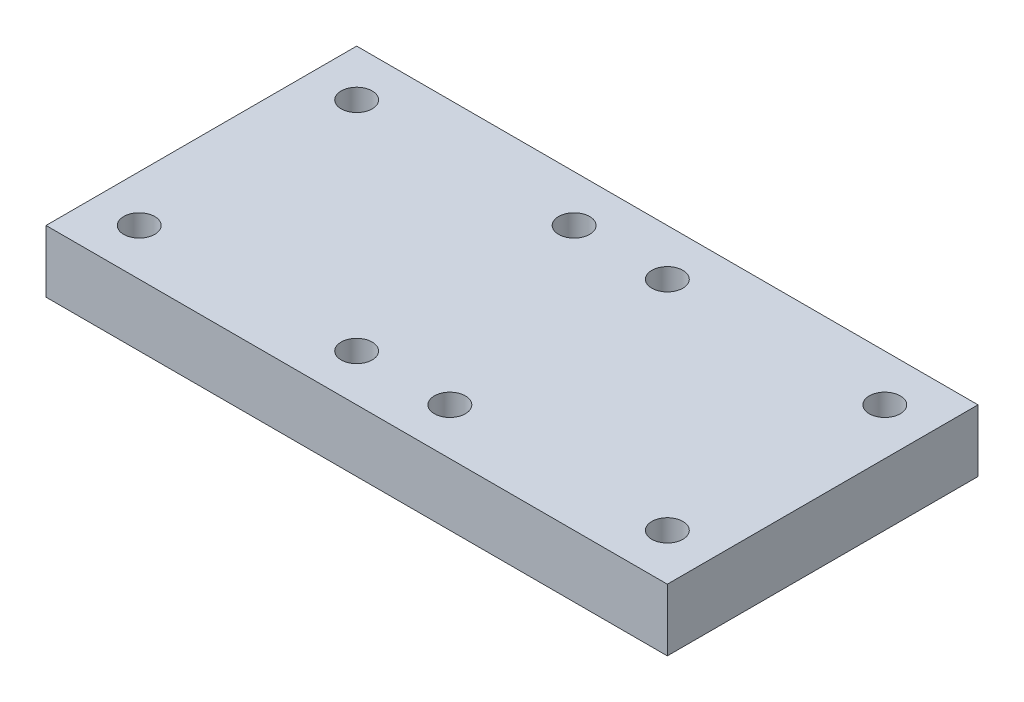
ISO-10303-21;
HEADER;
FILE_DESCRIPTION(('STEP AP214'),'2;1');
FILE_NAME('part.step','',(''),(''),'','','');
FILE_SCHEMA(('AUTOMOTIVE_DESIGN { 1 0 10303 214 1 1 1 1 }'));
ENDSEC;
DATA;
#1=APPLICATION_CONTEXT('core data for automotive mechanical design processes');
#2=APPLICATION_PROTOCOL_DEFINITION('international standard','automotive_design',2000,#1);
#3=PRODUCT_CONTEXT('',#1,'mechanical');
#4=PRODUCT('Part','Part','',(#3));
#5=PRODUCT_RELATED_PRODUCT_CATEGORY('part','',(#4));
#6=PRODUCT_DEFINITION_FORMATION('','',#4);
#7=PRODUCT_DEFINITION_CONTEXT('part definition',#1,'design');
#8=PRODUCT_DEFINITION('design','',#6,#7);
#9=PRODUCT_DEFINITION_SHAPE('','',#8);
#10=(LENGTH_UNIT() NAMED_UNIT(*) SI_UNIT(.MILLI.,.METRE.));
#11=(NAMED_UNIT(*) PLANE_ANGLE_UNIT() SI_UNIT($,.RADIAN.));
#12=(NAMED_UNIT(*) SI_UNIT($,.STERADIAN.) SOLID_ANGLE_UNIT());
#13=UNCERTAINTY_MEASURE_WITH_UNIT(LENGTH_MEASURE(1.E-05),#10,'distance_accuracy_value','');
#14=(GEOMETRIC_REPRESENTATION_CONTEXT(3) GLOBAL_UNCERTAINTY_ASSIGNED_CONTEXT((#13)) GLOBAL_UNIT_ASSIGNED_CONTEXT((#10,
#11,#12)) REPRESENTATION_CONTEXT('',''));
#15=CARTESIAN_POINT('',(0.,0.,0.));
#16=DIRECTION('',(0.,0.,1.));
#17=DIRECTION('',(1.,0.,0.));
#18=AXIS2_PLACEMENT_3D('',#15,#16,#17);
#19=CARTESIAN_POINT('',(0.,10.,0.));
#20=DIRECTION('',(0.,1.,0.));
#21=DIRECTION('',(0.,0.,1.));
#22=AXIS2_PLACEMENT_3D('',#19,#20,#21);
#23=PLANE('',#22);
#24=CARTESIAN_POINT('',(-7.5,10.,17.5));
#25=DIRECTION('',(0.,1.,0.));
#26=DIRECTION('',(0.,0.,1.));
#27=AXIS2_PLACEMENT_3D('',#24,#25,#26);
#28=CIRCLE('',#27,2.5);
#29=CARTESIAN_POINT('',(-7.5,10.,20.));
#30=VERTEX_POINT('',#29);
#31=EDGE_CURVE('E178',#30,#30,#28,.T.);
#32=ORIENTED_EDGE('',*,*,#31,.F.);
#33=EDGE_LOOP('',(#32));
#34=FACE_BOUND('',#33,.T.);
#35=CARTESIAN_POINT('',(7.5,10.,17.5));
#36=DIRECTION('',(0.,1.,0.));
#37=DIRECTION('',(0.,0.,1.));
#38=AXIS2_PLACEMENT_3D('',#35,#36,#37);
#39=CIRCLE('',#38,2.5);
#40=CARTESIAN_POINT('',(7.5,10.,20.));
#41=VERTEX_POINT('',#40);
#42=EDGE_CURVE('E186',#41,#41,#39,.T.);
#43=ORIENTED_EDGE('',*,*,#42,.F.);
#44=EDGE_LOOP('',(#43));
#45=FACE_BOUND('',#44,.T.);
#46=CARTESIAN_POINT('',(7.5,10.,-17.5));
#47=DIRECTION('',(0.,1.,0.));
#48=DIRECTION('',(0.,0.,1.));
#49=AXIS2_PLACEMENT_3D('',#46,#47,#48);
#50=CIRCLE('',#49,2.5);
#51=CARTESIAN_POINT('',(7.5,10.,-15.));
#52=VERTEX_POINT('',#51);
#53=EDGE_CURVE('E170',#52,#52,#50,.T.);
#54=ORIENTED_EDGE('',*,*,#53,.F.);
#55=EDGE_LOOP('',(#54));
#56=FACE_BOUND('',#55,.T.);
#57=CARTESIAN_POINT('',(-7.5,10.,-17.5));
#58=DIRECTION('',(0.,1.,0.));
#59=DIRECTION('',(0.,0.,1.));
#60=AXIS2_PLACEMENT_3D('',#57,#58,#59);
#61=CIRCLE('',#60,2.5);
#62=CARTESIAN_POINT('',(-7.5,10.,-15.));
#63=VERTEX_POINT('',#62);
#64=EDGE_CURVE('E166',#63,#63,#61,.T.);
#65=ORIENTED_EDGE('',*,*,#64,.F.);
#66=EDGE_LOOP('',(#65));
#67=FACE_BOUND('',#66,.T.);
#68=CARTESIAN_POINT('',(42.5,10.,17.5));
#69=DIRECTION('',(0.,1.,0.));
#70=DIRECTION('',(0.,0.,1.));
#71=AXIS2_PLACEMENT_3D('',#68,#69,#70);
#72=CIRCLE('',#71,2.5);
#73=CARTESIAN_POINT('',(42.5,10.,20.));
#74=VERTEX_POINT('',#73);
#75=EDGE_CURVE('E146',#74,#74,#72,.T.);
#76=ORIENTED_EDGE('',*,*,#75,.F.);
#77=EDGE_LOOP('',(#76));
#78=FACE_BOUND('',#77,.T.);
#79=CARTESIAN_POINT('',(-42.5,10.,-17.5));
#80=DIRECTION('',(0.,1.,0.));
#81=DIRECTION('',(0.,0.,1.));
#82=AXIS2_PLACEMENT_3D('',#79,#80,#81);
#83=CIRCLE('',#82,2.5);
#84=CARTESIAN_POINT('',(-42.5,10.,-15.));
#85=VERTEX_POINT('',#84);
#86=EDGE_CURVE('E116',#85,#85,#83,.T.);
#87=ORIENTED_EDGE('',*,*,#86,.F.);
#88=EDGE_LOOP('',(#87));
#89=FACE_BOUND('',#88,.T.);
#90=DIRECTION('',(0.,0.,-1.));
#91=VECTOR('',#90,1.);
#92=CARTESIAN_POINT('',(50.,10.,-25.));
#93=LINE('',#92,#91);
#94=CARTESIAN_POINT('',(50.,10.,25.));
#95=VERTEX_POINT('',#94);
#96=CARTESIAN_POINT('',(50.,10.,-25.));
#97=VERTEX_POINT('',#96);
#98=EDGE_CURVE('E96',#95,#97,#93,.T.);
#99=ORIENTED_EDGE('',*,*,#98,.T.);
#100=DIRECTION('',(-1.,0.,0.));
#101=VECTOR('',#100,1.);
#102=CARTESIAN_POINT('',(-50.,10.,-25.));
#103=LINE('',#102,#101);
#104=CARTESIAN_POINT('',(-50.,10.,-25.));
#105=VERTEX_POINT('',#104);
#106=EDGE_CURVE('E91',#97,#105,#103,.T.);
#107=ORIENTED_EDGE('',*,*,#106,.T.);
#108=DIRECTION('',(0.,0.,1.));
#109=VECTOR('',#108,1.);
#110=CARTESIAN_POINT('',(-50.,10.,-25.));
#111=LINE('',#110,#109);
#112=CARTESIAN_POINT('',(-50.,10.,25.));
#113=VERTEX_POINT('',#112);
#114=EDGE_CURVE('E94',#105,#113,#111,.T.);
#115=ORIENTED_EDGE('',*,*,#114,.T.);
#116=DIRECTION('',(1.,0.,0.));
#117=VECTOR('',#116,1.);
#118=CARTESIAN_POINT('',(-50.,10.,25.));
#119=LINE('',#118,#117);
#120=EDGE_CURVE('E61',#113,#95,#119,.T.);
#121=ORIENTED_EDGE('',*,*,#120,.T.);
#122=EDGE_LOOP('',(#99,#107,#115,#121));
#123=FACE_BOUND('',#122,.T.);
#124=CARTESIAN_POINT('',(42.5,10.,-17.5));
#125=DIRECTION('',(0.,1.,0.));
#126=DIRECTION('',(0.,0.,1.));
#127=AXIS2_PLACEMENT_3D('',#124,#125,#126);
#128=CIRCLE('',#127,2.5);
#129=CARTESIAN_POINT('',(42.5,10.,-15.));
#130=VERTEX_POINT('',#129);
#131=EDGE_CURVE('E138',#130,#130,#128,.T.);
#132=ORIENTED_EDGE('',*,*,#131,.F.);
#133=EDGE_LOOP('',(#132));
#134=FACE_BOUND('',#133,.T.);
#135=CARTESIAN_POINT('',(-42.5,10.,17.5));
#136=DIRECTION('',(0.,1.,0.));
#137=DIRECTION('',(0.,0.,1.));
#138=AXIS2_PLACEMENT_3D('',#135,#136,#137);
#139=CIRCLE('',#138,2.5);
#140=CARTESIAN_POINT('',(-42.5,10.,20.));
#141=VERTEX_POINT('',#140);
#142=EDGE_CURVE('E154',#141,#141,#139,.T.);
#143=ORIENTED_EDGE('',*,*,#142,.F.);
#144=EDGE_LOOP('',(#143));
#145=FACE_BOUND('',#144,.T.);
#146=ADVANCED_FACE('F43',(#34,#45,#56,#67,#78,#89,#123,#134,#145),#23,.T.);
#147=CARTESIAN_POINT('',(0.,0.,0.));
#148=DIRECTION('',(0.,1.,0.));
#149=DIRECTION('',(0.,0.,1.));
#150=AXIS2_PLACEMENT_3D('',#147,#148,#149);
#151=PLANE('',#150);
#152=CARTESIAN_POINT('',(-7.5,0.,17.5));
#153=DIRECTION('',(0.,1.,0.));
#154=DIRECTION('',(0.,0.,1.));
#155=AXIS2_PLACEMENT_3D('',#152,#153,#154);
#156=CIRCLE('',#155,2.5);
#157=CARTESIAN_POINT('',(-7.5,0.,20.));
#158=VERTEX_POINT('',#157);
#159=EDGE_CURVE('E174',#158,#158,#156,.T.);
#160=ORIENTED_EDGE('',*,*,#159,.T.);
#161=EDGE_LOOP('',(#160));
#162=FACE_BOUND('',#161,.T.);
#163=CARTESIAN_POINT('',(7.5,0.,17.5));
#164=DIRECTION('',(0.,1.,0.));
#165=DIRECTION('',(0.,0.,1.));
#166=AXIS2_PLACEMENT_3D('',#163,#164,#165);
#167=CIRCLE('',#166,2.5);
#168=CARTESIAN_POINT('',(7.5,0.,20.));
#169=VERTEX_POINT('',#168);
#170=EDGE_CURVE('E182',#169,#169,#167,.T.);
#171=ORIENTED_EDGE('',*,*,#170,.T.);
#172=EDGE_LOOP('',(#171));
#173=FACE_BOUND('',#172,.T.);
#174=CARTESIAN_POINT('',(7.5,0.,-17.5));
#175=DIRECTION('',(0.,1.,0.));
#176=DIRECTION('',(0.,0.,1.));
#177=AXIS2_PLACEMENT_3D('',#174,#175,#176);
#178=CIRCLE('',#177,2.5);
#179=CARTESIAN_POINT('',(7.5,0.,-15.));
#180=VERTEX_POINT('',#179);
#181=EDGE_CURVE('E190',#180,#180,#178,.T.);
#182=ORIENTED_EDGE('',*,*,#181,.T.);
#183=EDGE_LOOP('',(#182));
#184=FACE_BOUND('',#183,.T.);
#185=CARTESIAN_POINT('',(-7.5,0.,-17.5));
#186=DIRECTION('',(0.,1.,0.));
#187=DIRECTION('',(0.,0.,1.));
#188=AXIS2_PLACEMENT_3D('',#185,#186,#187);
#189=CIRCLE('',#188,2.5);
#190=CARTESIAN_POINT('',(-7.5,0.,-15.));
#191=VERTEX_POINT('',#190);
#192=EDGE_CURVE('E162',#191,#191,#189,.T.);
#193=ORIENTED_EDGE('',*,*,#192,.T.);
#194=EDGE_LOOP('',(#193));
#195=FACE_BOUND('',#194,.T.);
#196=DIRECTION('',(0.,0.,-1.));
#197=VECTOR('',#196,1.);
#198=CARTESIAN_POINT('',(50.,0.,-25.));
#199=LINE('',#198,#197);
#200=CARTESIAN_POINT('',(50.,0.,25.));
#201=VERTEX_POINT('',#200);
#202=CARTESIAN_POINT('',(50.,0.,-25.));
#203=VERTEX_POINT('',#202);
#204=EDGE_CURVE('E112',#201,#203,#199,.T.);
#205=ORIENTED_EDGE('',*,*,#204,.F.);
#206=DIRECTION('',(1.,0.,0.));
#207=VECTOR('',#206,1.);
#208=CARTESIAN_POINT('',(-50.,0.,25.));
#209=LINE('',#208,#207);
#210=CARTESIAN_POINT('',(-50.,0.,25.));
#211=VERTEX_POINT('',#210);
#212=EDGE_CURVE('E84',#211,#201,#209,.T.);
#213=ORIENTED_EDGE('',*,*,#212,.F.);
#214=DIRECTION('',(0.,0.,1.));
#215=VECTOR('',#214,1.);
#216=CARTESIAN_POINT('',(-50.,0.,-25.));
#217=LINE('',#216,#215);
#218=CARTESIAN_POINT('',(-50.,0.,-25.));
#219=VERTEX_POINT('',#218);
#220=EDGE_CURVE('E78',#219,#211,#217,.T.);
#221=ORIENTED_EDGE('',*,*,#220,.F.);
#222=DIRECTION('',(-1.,0.,0.));
#223=VECTOR('',#222,1.);
#224=CARTESIAN_POINT('',(-50.,0.,-25.));
#225=LINE('',#224,#223);
#226=EDGE_CURVE('E101',#203,#219,#225,.T.);
#227=ORIENTED_EDGE('',*,*,#226,.F.);
#228=EDGE_LOOP('',(#205,#213,#221,#227));
#229=FACE_BOUND('',#228,.T.);
#230=CARTESIAN_POINT('',(-42.5,0.,-17.5));
#231=DIRECTION('',(0.,1.,0.));
#232=DIRECTION('',(0.,0.,1.));
#233=AXIS2_PLACEMENT_3D('',#230,#231,#232);
#234=CIRCLE('',#233,2.5);
#235=CARTESIAN_POINT('',(-42.5,0.,-15.));
#236=VERTEX_POINT('',#235);
#237=EDGE_CURVE('E134',#236,#236,#234,.T.);
#238=ORIENTED_EDGE('',*,*,#237,.T.);
#239=EDGE_LOOP('',(#238));
#240=FACE_BOUND('',#239,.T.);
#241=CARTESIAN_POINT('',(42.5,0.,-17.5));
#242=DIRECTION('',(0.,1.,0.));
#243=DIRECTION('',(0.,0.,1.));
#244=AXIS2_PLACEMENT_3D('',#241,#242,#243);
#245=CIRCLE('',#244,2.5);
#246=CARTESIAN_POINT('',(42.5,0.,-15.));
#247=VERTEX_POINT('',#246);
#248=EDGE_CURVE('E142',#247,#247,#245,.T.);
#249=ORIENTED_EDGE('',*,*,#248,.T.);
#250=EDGE_LOOP('',(#249));
#251=FACE_BOUND('',#250,.T.);
#252=CARTESIAN_POINT('',(42.5,0.,17.5));
#253=DIRECTION('',(0.,1.,0.));
#254=DIRECTION('',(0.,0.,1.));
#255=AXIS2_PLACEMENT_3D('',#252,#253,#254);
#256=CIRCLE('',#255,2.5);
#257=CARTESIAN_POINT('',(42.5,0.,20.));
#258=VERTEX_POINT('',#257);
#259=EDGE_CURVE('E150',#258,#258,#256,.T.);
#260=ORIENTED_EDGE('',*,*,#259,.T.);
#261=EDGE_LOOP('',(#260));
#262=FACE_BOUND('',#261,.T.);
#263=CARTESIAN_POINT('',(-42.5,0.,17.5));
#264=DIRECTION('',(0.,1.,0.));
#265=DIRECTION('',(0.,0.,1.));
#266=AXIS2_PLACEMENT_3D('',#263,#264,#265);
#267=CIRCLE('',#266,2.5);
#268=CARTESIAN_POINT('',(-42.5,0.,20.));
#269=VERTEX_POINT('',#268);
#270=EDGE_CURVE('E158',#269,#269,#267,.T.);
#271=ORIENTED_EDGE('',*,*,#270,.T.);
#272=EDGE_LOOP('',(#271));
#273=FACE_BOUND('',#272,.T.);
#274=ADVANCED_FACE('F129',(#162,#173,#184,#195,#229,#240,#251,#262,#273),#151,.F.);
#275=CARTESIAN_POINT('',(50.,10.,-25.));
#276=DIRECTION('',(-1.,0.,0.));
#277=DIRECTION('',(0.,0.,1.));
#278=AXIS2_PLACEMENT_3D('',#275,#276,#277);
#279=PLANE('',#278);
#280=ORIENTED_EDGE('',*,*,#204,.T.);
#281=DIRECTION('',(0.,-1.,0.));
#282=VECTOR('',#281,1.);
#283=CARTESIAN_POINT('',(50.,10.,-25.));
#284=LINE('',#283,#282);
#285=EDGE_CURVE('E11',#97,#203,#284,.T.);
#286=ORIENTED_EDGE('',*,*,#285,.F.);
#287=ORIENTED_EDGE('',*,*,#98,.F.);
#288=DIRECTION('',(0.,-1.,0.));
#289=VECTOR('',#288,1.);
#290=CARTESIAN_POINT('',(50.,10.,25.));
#291=LINE('',#290,#289);
#292=EDGE_CURVE('E108',#95,#201,#291,.T.);
#293=ORIENTED_EDGE('',*,*,#292,.T.);
#294=EDGE_LOOP('',(#280,#286,#287,#293));
#295=FACE_BOUND('',#294,.T.);
#296=ADVANCED_FACE('F45',(#295),#279,.F.);
#297=CARTESIAN_POINT('',(-50.,10.,-25.));
#298=DIRECTION('',(0.,0.,1.));
#299=DIRECTION('',(1.,0.,0.));
#300=AXIS2_PLACEMENT_3D('',#297,#298,#299);
#301=PLANE('',#300);
#302=ORIENTED_EDGE('',*,*,#226,.T.);
#303=DIRECTION('',(0.,-1.,0.));
#304=VECTOR('',#303,1.);
#305=CARTESIAN_POINT('',(-50.,10.,-25.));
#306=LINE('',#305,#304);
#307=EDGE_CURVE('E53',#105,#219,#306,.T.);
#308=ORIENTED_EDGE('',*,*,#307,.F.);
#309=ORIENTED_EDGE('',*,*,#106,.F.);
#310=ORIENTED_EDGE('',*,*,#285,.T.);
#311=EDGE_LOOP('',(#302,#308,#309,#310));
#312=FACE_BOUND('',#311,.T.);
#313=ADVANCED_FACE('F100',(#312),#301,.F.);
#314=CARTESIAN_POINT('',(-50.,10.,-25.));
#315=DIRECTION('',(1.,0.,0.));
#316=DIRECTION('',(0.,0.,-1.));
#317=AXIS2_PLACEMENT_3D('',#314,#315,#316);
#318=PLANE('',#317);
#319=ORIENTED_EDGE('',*,*,#220,.T.);
#320=DIRECTION('',(0.,-1.,0.));
#321=VECTOR('',#320,1.);
#322=CARTESIAN_POINT('',(-50.,10.,25.));
#323=LINE('',#322,#321);
#324=EDGE_CURVE('E103',#113,#211,#323,.T.);
#325=ORIENTED_EDGE('',*,*,#324,.F.);
#326=ORIENTED_EDGE('',*,*,#114,.F.);
#327=ORIENTED_EDGE('',*,*,#307,.T.);
#328=EDGE_LOOP('',(#319,#325,#326,#327));
#329=FACE_BOUND('',#328,.T.);
#330=ADVANCED_FACE('F104',(#329),#318,.F.);
#331=CARTESIAN_POINT('',(-50.,10.,25.));
#332=DIRECTION('',(0.,0.,-1.));
#333=DIRECTION('',(-1.,0.,0.));
#334=AXIS2_PLACEMENT_3D('',#331,#332,#333);
#335=PLANE('',#334);
#336=ORIENTED_EDGE('',*,*,#212,.T.);
#337=ORIENTED_EDGE('',*,*,#292,.F.);
#338=ORIENTED_EDGE('',*,*,#120,.F.);
#339=ORIENTED_EDGE('',*,*,#324,.T.);
#340=EDGE_LOOP('',(#336,#337,#338,#339));
#341=FACE_BOUND('',#340,.T.);
#342=ADVANCED_FACE('F126',(#341),#335,.F.);
#343=CARTESIAN_POINT('',(-42.5,10.,-17.5));
#344=DIRECTION('',(0.,-1.,0.));
#345=DIRECTION('',(0.,0.,-1.));
#346=AXIS2_PLACEMENT_3D('',#343,#344,#345);
#347=CYLINDRICAL_SURFACE('',#346,2.5);
#348=ORIENTED_EDGE('',*,*,#86,.T.);
#349=EDGE_LOOP('',(#348));
#350=FACE_BOUND('',#349,.T.);
#351=ORIENTED_EDGE('',*,*,#237,.F.);
#352=EDGE_LOOP('',(#351));
#353=FACE_BOUND('',#352,.T.);
#354=ADVANCED_FACE('F210',(#350,#353),#347,.F.);
#355=CARTESIAN_POINT('',(42.5,10.,-17.5));
#356=DIRECTION('',(0.,-1.,0.));
#357=DIRECTION('',(0.,0.,-1.));
#358=AXIS2_PLACEMENT_3D('',#355,#356,#357);
#359=CYLINDRICAL_SURFACE('',#358,2.5);
#360=ORIENTED_EDGE('',*,*,#131,.T.);
#361=EDGE_LOOP('',(#360));
#362=FACE_BOUND('',#361,.T.);
#363=ORIENTED_EDGE('',*,*,#248,.F.);
#364=EDGE_LOOP('',(#363));
#365=FACE_BOUND('',#364,.T.);
#366=ADVANCED_FACE('F213',(#362,#365),#359,.F.);
#367=CARTESIAN_POINT('',(42.5,10.,17.5));
#368=DIRECTION('',(0.,-1.,0.));
#369=DIRECTION('',(0.,0.,-1.));
#370=AXIS2_PLACEMENT_3D('',#367,#368,#369);
#371=CYLINDRICAL_SURFACE('',#370,2.5);
#372=ORIENTED_EDGE('',*,*,#75,.T.);
#373=EDGE_LOOP('',(#372));
#374=FACE_BOUND('',#373,.T.);
#375=ORIENTED_EDGE('',*,*,#259,.F.);
#376=EDGE_LOOP('',(#375));
#377=FACE_BOUND('',#376,.T.);
#378=ADVANCED_FACE('F229',(#374,#377),#371,.F.);
#379=CARTESIAN_POINT('',(-42.5,10.,17.5));
#380=DIRECTION('',(0.,-1.,0.));
#381=DIRECTION('',(0.,0.,-1.));
#382=AXIS2_PLACEMENT_3D('',#379,#380,#381);
#383=CYLINDRICAL_SURFACE('',#382,2.5);
#384=ORIENTED_EDGE('',*,*,#142,.T.);
#385=EDGE_LOOP('',(#384));
#386=FACE_BOUND('',#385,.T.);
#387=ORIENTED_EDGE('',*,*,#270,.F.);
#388=EDGE_LOOP('',(#387));
#389=FACE_BOUND('',#388,.T.);
#390=ADVANCED_FACE('F226',(#386,#389),#383,.F.);
#391=CARTESIAN_POINT('',(-7.5,0.,-17.5));
#392=DIRECTION('',(0.,1.,0.));
#393=DIRECTION('',(0.,0.,1.));
#394=AXIS2_PLACEMENT_3D('',#391,#392,#393);
#395=CYLINDRICAL_SURFACE('',#394,2.5);
#396=ORIENTED_EDGE('',*,*,#192,.F.);
#397=EDGE_LOOP('',(#396));
#398=FACE_BOUND('',#397,.T.);
#399=ORIENTED_EDGE('',*,*,#64,.T.);
#400=EDGE_LOOP('',(#399));
#401=FACE_BOUND('',#400,.T.);
#402=ADVANCED_FACE('F228',(#398,#401),#395,.F.);
#403=CARTESIAN_POINT('',(7.5,0.,-17.5));
#404=DIRECTION('',(0.,1.,0.));
#405=DIRECTION('',(0.,0.,1.));
#406=AXIS2_PLACEMENT_3D('',#403,#404,#405);
#407=CYLINDRICAL_SURFACE('',#406,2.5);
#408=ORIENTED_EDGE('',*,*,#181,.F.);
#409=EDGE_LOOP('',(#408));
#410=FACE_BOUND('',#409,.T.);
#411=ORIENTED_EDGE('',*,*,#53,.T.);
#412=EDGE_LOOP('',(#411));
#413=FACE_BOUND('',#412,.T.);
#414=ADVANCED_FACE('F198',(#410,#413),#407,.F.);
#415=CARTESIAN_POINT('',(7.5,0.,17.5));
#416=DIRECTION('',(0.,1.,0.));
#417=DIRECTION('',(0.,0.,1.));
#418=AXIS2_PLACEMENT_3D('',#415,#416,#417);
#419=CYLINDRICAL_SURFACE('',#418,2.5);
#420=ORIENTED_EDGE('',*,*,#170,.F.);
#421=EDGE_LOOP('',(#420));
#422=FACE_BOUND('',#421,.T.);
#423=ORIENTED_EDGE('',*,*,#42,.T.);
#424=EDGE_LOOP('',(#423));
#425=FACE_BOUND('',#424,.T.);
#426=ADVANCED_FACE('F339',(#422,#425),#419,.F.);
#427=CARTESIAN_POINT('',(-7.5,0.,17.5));
#428=DIRECTION('',(0.,1.,0.));
#429=DIRECTION('',(0.,0.,1.));
#430=AXIS2_PLACEMENT_3D('',#427,#428,#429);
#431=CYLINDRICAL_SURFACE('',#430,2.5);
#432=ORIENTED_EDGE('',*,*,#159,.F.);
#433=EDGE_LOOP('',(#432));
#434=FACE_BOUND('',#433,.T.);
#435=ORIENTED_EDGE('',*,*,#31,.T.);
#436=EDGE_LOOP('',(#435));
#437=FACE_BOUND('',#436,.T.);
#438=ADVANCED_FACE('F349',(#434,#437),#431,.F.);
#439=CLOSED_SHELL('',(#146,#274,#296,#313,#330,#342,#354,#366,#378,#390,#402,#414,#426,#438));
#440=MANIFOLD_SOLID_BREP('B2',#439);
#441=ADVANCED_BREP_SHAPE_REPRESENTATION('',(#18,#440),#14);
#442=SHAPE_DEFINITION_REPRESENTATION(#9,#441);
ENDSEC;
END-ISO-10303-21;
